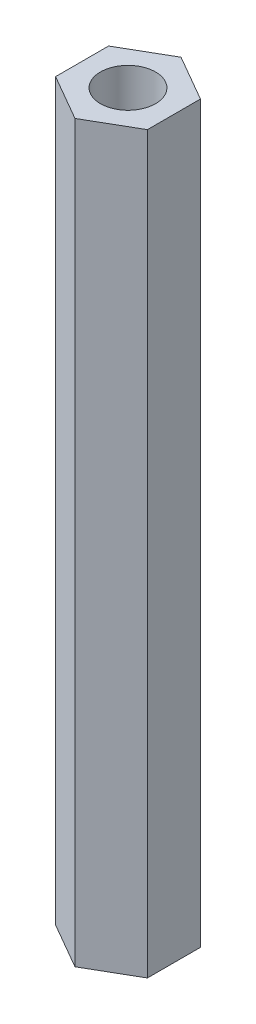
ISO-10303-21;
HEADER;
FILE_DESCRIPTION(('STEP AP214'),'2;1');
FILE_NAME('part.step','',(''),(''),'','','');
FILE_SCHEMA(('AUTOMOTIVE_DESIGN { 1 0 10303 214 1 1 1 1 }'));
ENDSEC;
DATA;
#1=APPLICATION_CONTEXT('core data for automotive mechanical design processes');
#2=APPLICATION_PROTOCOL_DEFINITION('international standard','automotive_design',2000,#1);
#3=PRODUCT_CONTEXT('',#1,'mechanical');
#4=PRODUCT('Part','Part','',(#3));
#5=PRODUCT_RELATED_PRODUCT_CATEGORY('part','',(#4));
#6=PRODUCT_DEFINITION_FORMATION('','',#4);
#7=PRODUCT_DEFINITION_CONTEXT('part definition',#1,'design');
#8=PRODUCT_DEFINITION('design','',#6,#7);
#9=PRODUCT_DEFINITION_SHAPE('','',#8);
#10=(LENGTH_UNIT() NAMED_UNIT(*) SI_UNIT(.MILLI.,.METRE.));
#11=(NAMED_UNIT(*) PLANE_ANGLE_UNIT() SI_UNIT($,.RADIAN.));
#12=(NAMED_UNIT(*) SI_UNIT($,.STERADIAN.) SOLID_ANGLE_UNIT());
#13=UNCERTAINTY_MEASURE_WITH_UNIT(LENGTH_MEASURE(1.E-05),#10,'distance_accuracy_value','');
#14=(GEOMETRIC_REPRESENTATION_CONTEXT(3) GLOBAL_UNCERTAINTY_ASSIGNED_CONTEXT((#13)) GLOBAL_UNIT_ASSIGNED_CONTEXT((#10,
#11,#12)) REPRESENTATION_CONTEXT('',''));
#15=CARTESIAN_POINT('',(0.,0.,0.));
#16=DIRECTION('',(0.,0.,1.));
#17=DIRECTION('',(1.,0.,0.));
#18=AXIS2_PLACEMENT_3D('',#15,#16,#17);
#19=CARTESIAN_POINT('',(0.,40.,0.));
#20=DIRECTION('',(0.,1.,0.));
#21=DIRECTION('',(0.,0.,1.));
#22=AXIS2_PLACEMENT_3D('',#19,#20,#21);
#23=PLANE('',#22);
#24=DIRECTION('',(-0.866025403784439,0.,-0.5));
#25=VECTOR('',#24,1.);
#26=CARTESIAN_POINT('',(2.5,40.,-1.44337567297407));
#27=LINE('',#26,#25);
#28=CARTESIAN_POINT('',(2.5,40.,-1.44337567297407));
#29=VERTEX_POINT('',#28);
#30=CARTESIAN_POINT('',(0.,40.,-2.88675134594813));
#31=VERTEX_POINT('',#30);
#32=EDGE_CURVE('E129',#29,#31,#27,.T.);
#33=ORIENTED_EDGE('',*,*,#32,.T.);
#34=DIRECTION('',(-0.866025403784439,0.,0.5));
#35=VECTOR('',#34,1.);
#36=CARTESIAN_POINT('',(0.,40.,-2.88675134594813));
#37=LINE('',#36,#35);
#38=CARTESIAN_POINT('',(-2.5,40.,-1.44337567297407));
#39=VERTEX_POINT('',#38);
#40=EDGE_CURVE('E87',#31,#39,#37,.T.);
#41=ORIENTED_EDGE('',*,*,#40,.T.);
#42=DIRECTION('',(0.,0.,1.));
#43=VECTOR('',#42,1.);
#44=CARTESIAN_POINT('',(-2.5,40.,-1.44337567297407));
#45=LINE('',#44,#43);
#46=CARTESIAN_POINT('',(-2.5,40.,1.44337567297406));
#47=VERTEX_POINT('',#46);
#48=EDGE_CURVE('E100',#39,#47,#45,.T.);
#49=ORIENTED_EDGE('',*,*,#48,.T.);
#50=DIRECTION('',(0.866025403784439,0.,0.5));
#51=VECTOR('',#50,1.);
#52=CARTESIAN_POINT('',(-2.5,40.,1.44337567297406));
#53=LINE('',#52,#51);
#54=CARTESIAN_POINT('',(0.,40.,2.88675134594813));
#55=VERTEX_POINT('',#54);
#56=EDGE_CURVE('E94',#47,#55,#53,.T.);
#57=ORIENTED_EDGE('',*,*,#56,.T.);
#58=DIRECTION('',(0.866025403784439,0.,-0.5));
#59=VECTOR('',#58,1.);
#60=CARTESIAN_POINT('',(0.,40.,2.88675134594813));
#61=LINE('',#60,#59);
#62=CARTESIAN_POINT('',(2.5,40.,1.44337567297407));
#63=VERTEX_POINT('',#62);
#64=EDGE_CURVE('E98',#55,#63,#61,.T.);
#65=ORIENTED_EDGE('',*,*,#64,.T.);
#66=DIRECTION('',(0.,0.,-1.));
#67=VECTOR('',#66,1.);
#68=CARTESIAN_POINT('',(2.5,40.,1.44337567297407));
#69=LINE('',#68,#67);
#70=EDGE_CURVE('E50',#63,#29,#69,.T.);
#71=ORIENTED_EDGE('',*,*,#70,.T.);
#72=EDGE_LOOP('',(#33,#41,#49,#57,#65,#71));
#73=FACE_BOUND('',#72,.T.);
#74=CARTESIAN_POINT('',(0.,40.,0.));
#75=DIRECTION('',(0.,1.,0.));
#76=DIRECTION('',(0.,0.,1.));
#77=AXIS2_PLACEMENT_3D('',#74,#75,#76);
#78=CIRCLE('',#77,1.5);
#79=CARTESIAN_POINT('',(0.,40.,1.5));
#80=VERTEX_POINT('',#79);
#81=EDGE_CURVE('E122',#80,#80,#78,.T.);
#82=ORIENTED_EDGE('',*,*,#81,.F.);
#83=EDGE_LOOP('',(#82));
#84=FACE_BOUND('',#83,.T.);
#85=ADVANCED_FACE('F33',(#73,#84),#23,.T.);
#86=CARTESIAN_POINT('',(0.,0.,0.));
#87=DIRECTION('',(0.,1.,0.));
#88=DIRECTION('',(0.,0.,1.));
#89=AXIS2_PLACEMENT_3D('',#86,#87,#88);
#90=PLANE('',#89);
#91=DIRECTION('',(-0.866025403784439,0.,-0.5));
#92=VECTOR('',#91,1.);
#93=CARTESIAN_POINT('',(2.5,0.,-1.44337567297407));
#94=LINE('',#93,#92);
#95=CARTESIAN_POINT('',(2.5,0.,-1.44337567297407));
#96=VERTEX_POINT('',#95);
#97=CARTESIAN_POINT('',(0.,0.,-2.88675134594813));
#98=VERTEX_POINT('',#97);
#99=EDGE_CURVE('E118',#96,#98,#94,.T.);
#100=ORIENTED_EDGE('',*,*,#99,.F.);
#101=DIRECTION('',(0.,0.,-1.));
#102=VECTOR('',#101,1.);
#103=CARTESIAN_POINT('',(2.5,0.,1.44337567297407));
#104=LINE('',#103,#102);
#105=CARTESIAN_POINT('',(2.5,0.,1.44337567297407));
#106=VERTEX_POINT('',#105);
#107=EDGE_CURVE('E79',#106,#96,#104,.T.);
#108=ORIENTED_EDGE('',*,*,#107,.F.);
#109=DIRECTION('',(0.866025403784439,0.,-0.5));
#110=VECTOR('',#109,1.);
#111=CARTESIAN_POINT('',(0.,0.,2.88675134594813));
#112=LINE('',#111,#110);
#113=CARTESIAN_POINT('',(0.,0.,2.88675134594813));
#114=VERTEX_POINT('',#113);
#115=EDGE_CURVE('E73',#114,#106,#112,.T.);
#116=ORIENTED_EDGE('',*,*,#115,.F.);
#117=DIRECTION('',(0.866025403784439,0.,0.5));
#118=VECTOR('',#117,1.);
#119=CARTESIAN_POINT('',(-2.5,0.,1.44337567297406));
#120=LINE('',#119,#118);
#121=CARTESIAN_POINT('',(-2.5,0.,1.44337567297406));
#122=VERTEX_POINT('',#121);
#123=EDGE_CURVE('E108',#122,#114,#120,.T.);
#124=ORIENTED_EDGE('',*,*,#123,.F.);
#125=DIRECTION('',(0.,0.,1.));
#126=VECTOR('',#125,1.);
#127=CARTESIAN_POINT('',(-2.5,0.,-1.44337567297407));
#128=LINE('',#127,#126);
#129=CARTESIAN_POINT('',(-2.5,0.,-1.44337567297407));
#130=VERTEX_POINT('',#129);
#131=EDGE_CURVE('E124',#130,#122,#128,.T.);
#132=ORIENTED_EDGE('',*,*,#131,.F.);
#133=DIRECTION('',(-0.866025403784439,0.,0.5));
#134=VECTOR('',#133,1.);
#135=CARTESIAN_POINT('',(0.,0.,-2.88675134594813));
#136=LINE('',#135,#134);
#137=EDGE_CURVE('E121',#98,#130,#136,.T.);
#138=ORIENTED_EDGE('',*,*,#137,.F.);
#139=EDGE_LOOP('',(#100,#108,#116,#124,#132,#138));
#140=FACE_BOUND('',#139,.T.);
#141=CARTESIAN_POINT('',(0.,0.,0.));
#142=DIRECTION('',(0.,1.,0.));
#143=DIRECTION('',(0.,0.,1.));
#144=AXIS2_PLACEMENT_3D('',#141,#142,#143);
#145=CIRCLE('',#144,1.5);
#146=CARTESIAN_POINT('',(0.,0.,1.5));
#147=VERTEX_POINT('',#146);
#148=EDGE_CURVE('E222',#147,#147,#145,.T.);
#149=ORIENTED_EDGE('',*,*,#148,.T.);
#150=EDGE_LOOP('',(#149));
#151=FACE_BOUND('',#150,.T.);
#152=ADVANCED_FACE('F138',(#140,#151),#90,.F.);
#153=CARTESIAN_POINT('',(2.5,40.,-1.44337567297407));
#154=DIRECTION('',(-0.5,0.,0.866025403784439));
#155=DIRECTION('',(0.866025403784439,0.,0.5));
#156=AXIS2_PLACEMENT_3D('',#153,#154,#155);
#157=PLANE('',#156);
#158=ORIENTED_EDGE('',*,*,#99,.T.);
#159=DIRECTION('',(0.,-1.,0.));
#160=VECTOR('',#159,1.);
#161=CARTESIAN_POINT('',(0.,40.,-2.88675134594813));
#162=LINE('',#161,#160);
#163=EDGE_CURVE('E11',#31,#98,#162,.T.);
#164=ORIENTED_EDGE('',*,*,#163,.F.);
#165=ORIENTED_EDGE('',*,*,#32,.F.);
#166=DIRECTION('',(0.,-1.,0.));
#167=VECTOR('',#166,1.);
#168=CARTESIAN_POINT('',(2.5,40.,-1.44337567297407));
#169=LINE('',#168,#167);
#170=EDGE_CURVE('E114',#29,#96,#169,.T.);
#171=ORIENTED_EDGE('',*,*,#170,.T.);
#172=EDGE_LOOP('',(#158,#164,#165,#171));
#173=FACE_BOUND('',#172,.T.);
#174=ADVANCED_FACE('F35',(#173),#157,.F.);
#175=CARTESIAN_POINT('',(0.,40.,-2.88675134594813));
#176=DIRECTION('',(0.5,0.,0.866025403784439));
#177=DIRECTION('',(0.866025403784439,0.,-0.5));
#178=AXIS2_PLACEMENT_3D('',#175,#176,#177);
#179=PLANE('',#178);
#180=ORIENTED_EDGE('',*,*,#137,.T.);
#181=DIRECTION('',(0.,-1.,0.));
#182=VECTOR('',#181,1.);
#183=CARTESIAN_POINT('',(-2.5,40.,-1.44337567297407));
#184=LINE('',#183,#182);
#185=EDGE_CURVE('E42',#39,#130,#184,.T.);
#186=ORIENTED_EDGE('',*,*,#185,.F.);
#187=ORIENTED_EDGE('',*,*,#40,.F.);
#188=ORIENTED_EDGE('',*,*,#163,.T.);
#189=EDGE_LOOP('',(#180,#186,#187,#188));
#190=FACE_BOUND('',#189,.T.);
#191=ADVANCED_FACE('F163',(#190),#179,.F.);
#192=CARTESIAN_POINT('',(-2.5,40.,-1.44337567297407));
#193=DIRECTION('',(1.,0.,0.));
#194=DIRECTION('',(0.,0.,-1.));
#195=AXIS2_PLACEMENT_3D('',#192,#193,#194);
#196=PLANE('',#195);
#197=ORIENTED_EDGE('',*,*,#131,.T.);
#198=DIRECTION('',(0.,-1.,0.));
#199=VECTOR('',#198,1.);
#200=CARTESIAN_POINT('',(-2.5,40.,1.44337567297406));
#201=LINE('',#200,#199);
#202=EDGE_CURVE('E109',#47,#122,#201,.T.);
#203=ORIENTED_EDGE('',*,*,#202,.F.);
#204=ORIENTED_EDGE('',*,*,#48,.F.);
#205=ORIENTED_EDGE('',*,*,#185,.T.);
#206=EDGE_LOOP('',(#197,#203,#204,#205));
#207=FACE_BOUND('',#206,.T.);
#208=ADVANCED_FACE('F135',(#207),#196,.F.);
#209=CARTESIAN_POINT('',(-2.5,40.,1.44337567297406));
#210=DIRECTION('',(0.5,0.,-0.866025403784439));
#211=DIRECTION('',(-0.866025403784439,0.,-0.5));
#212=AXIS2_PLACEMENT_3D('',#209,#210,#211);
#213=PLANE('',#212);
#214=ORIENTED_EDGE('',*,*,#123,.T.);
#215=DIRECTION('',(0.,-1.,0.));
#216=VECTOR('',#215,1.);
#217=CARTESIAN_POINT('',(0.,40.,2.88675134594813));
#218=LINE('',#217,#216);
#219=EDGE_CURVE('E105',#55,#114,#218,.T.);
#220=ORIENTED_EDGE('',*,*,#219,.F.);
#221=ORIENTED_EDGE('',*,*,#56,.F.);
#222=ORIENTED_EDGE('',*,*,#202,.T.);
#223=EDGE_LOOP('',(#214,#220,#221,#222));
#224=FACE_BOUND('',#223,.T.);
#225=ADVANCED_FACE('F106',(#224),#213,.F.);
#226=CARTESIAN_POINT('',(0.,40.,2.88675134594813));
#227=DIRECTION('',(-0.5,0.,-0.866025403784439));
#228=DIRECTION('',(-0.866025403784439,0.,0.5));
#229=AXIS2_PLACEMENT_3D('',#226,#227,#228);
#230=PLANE('',#229);
#231=ORIENTED_EDGE('',*,*,#115,.T.);
#232=DIRECTION('',(0.,-1.,0.));
#233=VECTOR('',#232,1.);
#234=CARTESIAN_POINT('',(2.5,40.,1.44337567297407));
#235=LINE('',#234,#233);
#236=EDGE_CURVE('E110',#63,#106,#235,.T.);
#237=ORIENTED_EDGE('',*,*,#236,.F.);
#238=ORIENTED_EDGE('',*,*,#64,.F.);
#239=ORIENTED_EDGE('',*,*,#219,.T.);
#240=EDGE_LOOP('',(#231,#237,#238,#239));
#241=FACE_BOUND('',#240,.T.);
#242=ADVANCED_FACE('F112',(#241),#230,.F.);
#243=CARTESIAN_POINT('',(2.5,40.,1.44337567297407));
#244=DIRECTION('',(-1.,0.,0.));
#245=DIRECTION('',(0.,0.,1.));
#246=AXIS2_PLACEMENT_3D('',#243,#244,#245);
#247=PLANE('',#246);
#248=ORIENTED_EDGE('',*,*,#107,.T.);
#249=ORIENTED_EDGE('',*,*,#170,.F.);
#250=ORIENTED_EDGE('',*,*,#70,.F.);
#251=ORIENTED_EDGE('',*,*,#236,.T.);
#252=EDGE_LOOP('',(#248,#249,#250,#251));
#253=FACE_BOUND('',#252,.T.);
#254=ADVANCED_FACE('F143',(#253),#247,.F.);
#255=CARTESIAN_POINT('',(0.,40.,0.));
#256=DIRECTION('',(0.,-1.,0.));
#257=DIRECTION('',(0.,0.,-1.));
#258=AXIS2_PLACEMENT_3D('',#255,#256,#257);
#259=CYLINDRICAL_SURFACE('',#258,1.5);
#260=ORIENTED_EDGE('',*,*,#81,.T.);
#261=EDGE_LOOP('',(#260));
#262=FACE_BOUND('',#261,.T.);
#263=ORIENTED_EDGE('',*,*,#148,.F.);
#264=EDGE_LOOP('',(#263));
#265=FACE_BOUND('',#264,.T.);
#266=ADVANCED_FACE('F145',(#262,#265),#259,.F.);
#267=CLOSED_SHELL('',(#85,#152,#174,#191,#208,#225,#242,#254,#266));
#268=MANIFOLD_SOLID_BREP('B2',#267);
#269=ADVANCED_BREP_SHAPE_REPRESENTATION('',(#18,#268),#14);
#270=SHAPE_DEFINITION_REPRESENTATION(#9,#269);
ENDSEC;
END-ISO-10303-21;
